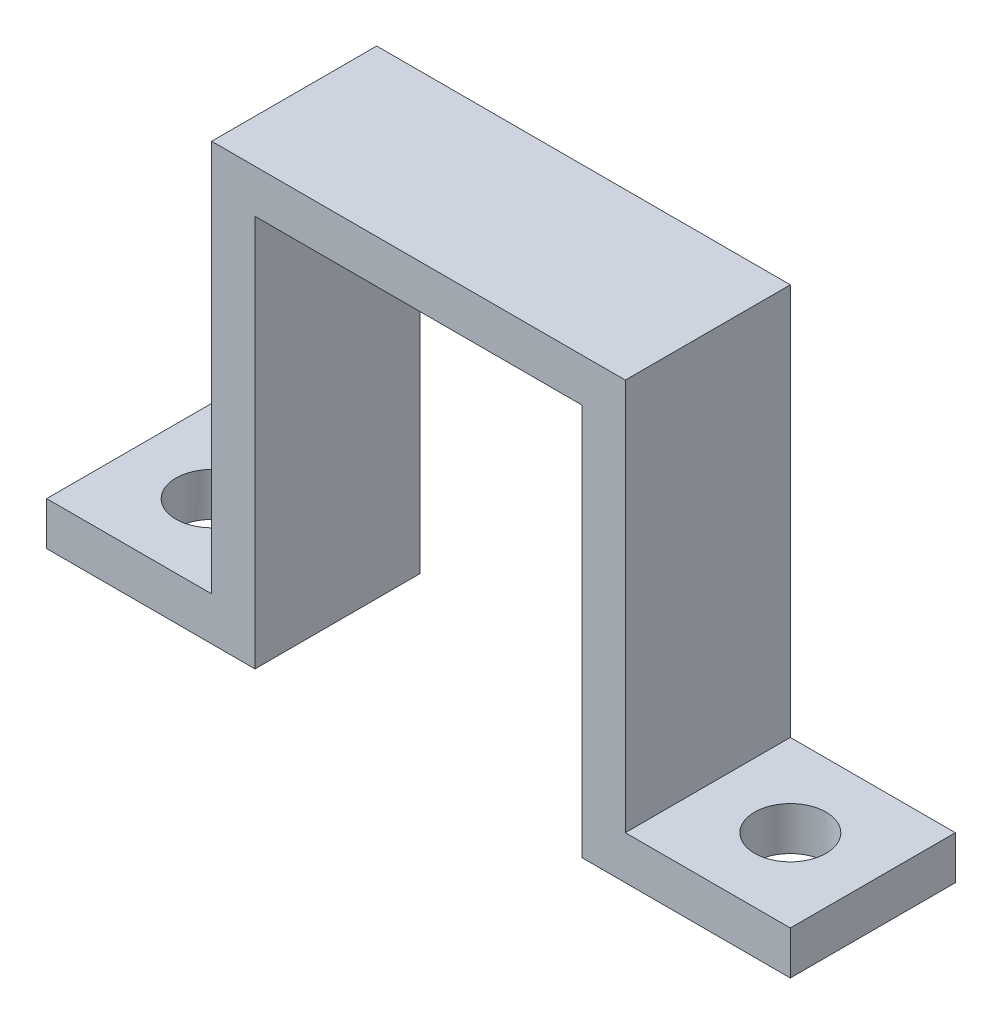
ISO-10303-21;
HEADER;
FILE_DESCRIPTION(('STEP AP214'),'2;1');
FILE_NAME('part.step','',(''),(''),'','','');
FILE_SCHEMA(('AUTOMOTIVE_DESIGN { 1 0 10303 214 1 1 1 1 }'));
ENDSEC;
DATA;
#1=APPLICATION_CONTEXT('core data for automotive mechanical design processes');
#2=APPLICATION_PROTOCOL_DEFINITION('international standard','automotive_design',2000,#1);
#3=PRODUCT_CONTEXT('',#1,'mechanical');
#4=PRODUCT('Part','Part','',(#3));
#5=PRODUCT_RELATED_PRODUCT_CATEGORY('part','',(#4));
#6=PRODUCT_DEFINITION_FORMATION('','',#4);
#7=PRODUCT_DEFINITION_CONTEXT('part definition',#1,'design');
#8=PRODUCT_DEFINITION('design','',#6,#7);
#9=PRODUCT_DEFINITION_SHAPE('','',#8);
#10=(LENGTH_UNIT() NAMED_UNIT(*) SI_UNIT(.MILLI.,.METRE.));
#11=(NAMED_UNIT(*) PLANE_ANGLE_UNIT() SI_UNIT($,.RADIAN.));
#12=(NAMED_UNIT(*) SI_UNIT($,.STERADIAN.) SOLID_ANGLE_UNIT());
#13=UNCERTAINTY_MEASURE_WITH_UNIT(LENGTH_MEASURE(1.E-05),#10,'distance_accuracy_value','');
#14=(GEOMETRIC_REPRESENTATION_CONTEXT(3) GLOBAL_UNCERTAINTY_ASSIGNED_CONTEXT((#13)) GLOBAL_UNIT_ASSIGNED_CONTEXT((#10,
#11,#12)) REPRESENTATION_CONTEXT('',''));
#15=CARTESIAN_POINT('',(0.,0.,0.));
#16=DIRECTION('',(0.,0.,1.));
#17=DIRECTION('',(1.,0.,0.));
#18=AXIS2_PLACEMENT_3D('',#15,#16,#17);
#19=CARTESIAN_POINT('',(-9.55,0.,3.81));
#20=DIRECTION('',(1.,0.,0.));
#21=DIRECTION('',(0.,1.,0.));
#22=AXIS2_PLACEMENT_3D('',#19,#20,#21);
#23=PLANE('',#22);
#24=DIRECTION('',(0.,-1.,0.));
#25=VECTOR('',#24,1.);
#26=CARTESIAN_POINT('',(-9.55,0.,-3.81));
#27=LINE('',#26,#25);
#28=CARTESIAN_POINT('',(-9.55,0.,-3.81));
#29=VERTEX_POINT('',#28);
#30=CARTESIAN_POINT('',(-9.55,-18.1,-3.81));
#31=VERTEX_POINT('',#30);
#32=EDGE_CURVE('E157',#29,#31,#27,.T.);
#33=ORIENTED_EDGE('',*,*,#32,.T.);
#34=DIRECTION('',(0.,0.,-1.));
#35=VECTOR('',#34,1.);
#36=CARTESIAN_POINT('',(-9.55,-18.1,3.81));
#37=LINE('',#36,#35);
#38=CARTESIAN_POINT('',(-9.55,-18.1,3.81));
#39=VERTEX_POINT('',#38);
#40=EDGE_CURVE('E11',#39,#31,#37,.T.);
#41=ORIENTED_EDGE('',*,*,#40,.F.);
#42=DIRECTION('',(0.,-1.,0.));
#43=VECTOR('',#42,1.);
#44=CARTESIAN_POINT('',(-9.55,0.,3.81));
#45=LINE('',#44,#43);
#46=CARTESIAN_POINT('',(-9.55,0.,3.81));
#47=VERTEX_POINT('',#46);
#48=EDGE_CURVE('E180',#47,#39,#45,.T.);
#49=ORIENTED_EDGE('',*,*,#48,.F.);
#50=DIRECTION('',(0.,0.,-1.));
#51=VECTOR('',#50,1.);
#52=CARTESIAN_POINT('',(-9.55,0.,3.81));
#53=LINE('',#52,#51);
#54=EDGE_CURVE('E153',#47,#29,#53,.T.);
#55=ORIENTED_EDGE('',*,*,#54,.T.);
#56=EDGE_LOOP('',(#33,#41,#49,#55));
#57=FACE_BOUND('',#56,.T.);
#58=ADVANCED_FACE('F37',(#57),#23,.F.);
#59=CARTESIAN_POINT('',(-9.55,-18.1,3.81));
#60=DIRECTION('',(0.,-1.,0.));
#61=DIRECTION('',(1.,0.,0.));
#62=AXIS2_PLACEMENT_3D('',#59,#60,#61);
#63=PLANE('',#62);
#64=CARTESIAN_POINT('',(-13.36,-18.1,0.));
#65=DIRECTION('',(0.,1.,0.));
#66=DIRECTION('',(0.,0.,1.));
#67=AXIS2_PLACEMENT_3D('',#64,#65,#66);
#68=CIRCLE('',#67,1.65);
#69=CARTESIAN_POINT('',(-13.36,-18.1,1.65));
#70=VERTEX_POINT('',#69);
#71=EDGE_CURVE('E300',#70,#70,#68,.T.);
#72=ORIENTED_EDGE('',*,*,#71,.F.);
#73=EDGE_LOOP('',(#72));
#74=FACE_BOUND('',#73,.T.);
#75=DIRECTION('',(-1.,0.,0.));
#76=VECTOR('',#75,1.);
#77=CARTESIAN_POINT('',(-9.55,-18.1,-3.81));
#78=LINE('',#77,#76);
#79=CARTESIAN_POINT('',(-17.17,-18.1,-3.81));
#80=VERTEX_POINT('',#79);
#81=EDGE_CURVE('E160',#31,#80,#78,.T.);
#82=ORIENTED_EDGE('',*,*,#81,.T.);
#83=DIRECTION('',(0.,0.,-1.));
#84=VECTOR('',#83,1.);
#85=CARTESIAN_POINT('',(-17.17,-18.1,3.81));
#86=LINE('',#85,#84);
#87=CARTESIAN_POINT('',(-17.17,-18.1,3.81));
#88=VERTEX_POINT('',#87);
#89=EDGE_CURVE('E45',#88,#80,#86,.T.);
#90=ORIENTED_EDGE('',*,*,#89,.F.);
#91=DIRECTION('',(-1.,0.,0.));
#92=VECTOR('',#91,1.);
#93=CARTESIAN_POINT('',(-9.55,-18.1,3.81));
#94=LINE('',#93,#92);
#95=EDGE_CURVE('E108',#39,#88,#94,.T.);
#96=ORIENTED_EDGE('',*,*,#95,.F.);
#97=ORIENTED_EDGE('',*,*,#40,.T.);
#98=EDGE_LOOP('',(#82,#90,#96,#97));
#99=FACE_BOUND('',#98,.T.);
#100=ADVANCED_FACE('F258',(#74,#99),#63,.F.);
#101=CARTESIAN_POINT('',(-17.17,-18.1,3.81));
#102=DIRECTION('',(1.,0.,0.));
#103=DIRECTION('',(0.,1.,0.));
#104=AXIS2_PLACEMENT_3D('',#101,#102,#103);
#105=PLANE('',#104);
#106=DIRECTION('',(0.,-1.,0.));
#107=VECTOR('',#106,1.);
#108=CARTESIAN_POINT('',(-17.17,-18.1,-3.81));
#109=LINE('',#108,#107);
#110=CARTESIAN_POINT('',(-17.17,-20.1,-3.81));
#111=VERTEX_POINT('',#110);
#112=EDGE_CURVE('E163',#80,#111,#109,.T.);
#113=ORIENTED_EDGE('',*,*,#112,.T.);
#114=DIRECTION('',(0.,0.,-1.));
#115=VECTOR('',#114,1.);
#116=CARTESIAN_POINT('',(-17.17,-20.1,3.81));
#117=LINE('',#116,#115);
#118=CARTESIAN_POINT('',(-17.17,-20.1,3.81));
#119=VERTEX_POINT('',#118);
#120=EDGE_CURVE('E199',#119,#111,#117,.T.);
#121=ORIENTED_EDGE('',*,*,#120,.F.);
#122=DIRECTION('',(0.,-1.,0.));
#123=VECTOR('',#122,1.);
#124=CARTESIAN_POINT('',(-17.17,-18.1,3.81));
#125=LINE('',#124,#123);
#126=EDGE_CURVE('E207',#88,#119,#125,.T.);
#127=ORIENTED_EDGE('',*,*,#126,.F.);
#128=ORIENTED_EDGE('',*,*,#89,.T.);
#129=EDGE_LOOP('',(#113,#121,#127,#128));
#130=FACE_BOUND('',#129,.T.);
#131=ADVANCED_FACE('F205',(#130),#105,.F.);
#132=CARTESIAN_POINT('',(-17.17,-20.1,3.81));
#133=DIRECTION('',(0.,1.,0.));
#134=DIRECTION('',(-1.,0.,0.));
#135=AXIS2_PLACEMENT_3D('',#132,#133,#134);
#136=PLANE('',#135);
#137=CARTESIAN_POINT('',(-13.36,-20.1,0.));
#138=DIRECTION('',(0.,1.,0.));
#139=DIRECTION('',(-1.,0.,0.));
#140=AXIS2_PLACEMENT_3D('',#137,#138,#139);
#141=CIRCLE('',#140,1.65);
#142=CARTESIAN_POINT('',(-15.01,-20.1,0.));
#143=VERTEX_POINT('',#142);
#144=EDGE_CURVE('E161',#143,#143,#141,.F.);
#145=ORIENTED_EDGE('',*,*,#144,.F.);
#146=EDGE_LOOP('',(#145));
#147=FACE_BOUND('',#146,.T.);
#148=DIRECTION('',(1.,0.,0.));
#149=VECTOR('',#148,1.);
#150=CARTESIAN_POINT('',(-17.17,-20.1,-3.81));
#151=LINE('',#150,#149);
#152=CARTESIAN_POINT('',(-7.55,-20.1,-3.81));
#153=VERTEX_POINT('',#152);
#154=EDGE_CURVE('E165',#111,#153,#151,.T.);
#155=ORIENTED_EDGE('',*,*,#154,.T.);
#156=DIRECTION('',(0.,0.,-1.));
#157=VECTOR('',#156,1.);
#158=CARTESIAN_POINT('',(-7.55,-20.1,3.81));
#159=LINE('',#158,#157);
#160=CARTESIAN_POINT('',(-7.55,-20.1,3.81));
#161=VERTEX_POINT('',#160);
#162=EDGE_CURVE('E196',#161,#153,#159,.T.);
#163=ORIENTED_EDGE('',*,*,#162,.F.);
#164=DIRECTION('',(1.,0.,0.));
#165=VECTOR('',#164,1.);
#166=CARTESIAN_POINT('',(-17.17,-20.1,3.81));
#167=LINE('',#166,#165);
#168=EDGE_CURVE('E225',#119,#161,#167,.T.);
#169=ORIENTED_EDGE('',*,*,#168,.F.);
#170=ORIENTED_EDGE('',*,*,#120,.T.);
#171=EDGE_LOOP('',(#155,#163,#169,#170));
#172=FACE_BOUND('',#171,.T.);
#173=ADVANCED_FACE('F216',(#147,#172),#136,.F.);
#174=CARTESIAN_POINT('',(-7.55,-20.1,3.81));
#175=DIRECTION('',(-1.,0.,0.));
#176=DIRECTION('',(0.,-1.,0.));
#177=AXIS2_PLACEMENT_3D('',#174,#175,#176);
#178=PLANE('',#177);
#179=DIRECTION('',(0.,1.,0.));
#180=VECTOR('',#179,1.);
#181=CARTESIAN_POINT('',(-7.55,-20.1,-3.81));
#182=LINE('',#181,#180);
#183=CARTESIAN_POINT('',(-7.55,-2.,-3.81));
#184=VERTEX_POINT('',#183);
#185=EDGE_CURVE('E167',#153,#184,#182,.T.);
#186=ORIENTED_EDGE('',*,*,#185,.T.);
#187=DIRECTION('',(0.,0.,-1.));
#188=VECTOR('',#187,1.);
#189=CARTESIAN_POINT('',(-7.55,-2.,3.81));
#190=LINE('',#189,#188);
#191=CARTESIAN_POINT('',(-7.55,-2.,3.81));
#192=VERTEX_POINT('',#191);
#193=EDGE_CURVE('E193',#192,#184,#190,.T.);
#194=ORIENTED_EDGE('',*,*,#193,.F.);
#195=DIRECTION('',(0.,1.,0.));
#196=VECTOR('',#195,1.);
#197=CARTESIAN_POINT('',(-7.55,-20.1,3.81));
#198=LINE('',#197,#196);
#199=EDGE_CURVE('E222',#161,#192,#198,.T.);
#200=ORIENTED_EDGE('',*,*,#199,.F.);
#201=ORIENTED_EDGE('',*,*,#162,.T.);
#202=EDGE_LOOP('',(#186,#194,#200,#201));
#203=FACE_BOUND('',#202,.T.);
#204=ADVANCED_FACE('F220',(#203),#178,.F.);
#205=CARTESIAN_POINT('',(-7.55,-2.,3.81));
#206=DIRECTION('',(0.,1.,0.));
#207=DIRECTION('',(0.,0.,1.));
#208=AXIS2_PLACEMENT_3D('',#205,#206,#207);
#209=PLANE('',#208);
#210=DIRECTION('',(1.,0.,0.));
#211=VECTOR('',#210,1.);
#212=CARTESIAN_POINT('',(-7.55,-2.,-3.81));
#213=LINE('',#212,#211);
#214=CARTESIAN_POINT('',(7.55,-2.,-3.81));
#215=VERTEX_POINT('',#214);
#216=EDGE_CURVE('E169',#184,#215,#213,.T.);
#217=ORIENTED_EDGE('',*,*,#216,.T.);
#218=DIRECTION('',(0.,0.,-1.));
#219=VECTOR('',#218,1.);
#220=CARTESIAN_POINT('',(7.55,-2.,3.81));
#221=LINE('',#220,#219);
#222=CARTESIAN_POINT('',(7.55,-2.,3.81));
#223=VERTEX_POINT('',#222);
#224=EDGE_CURVE('E190',#223,#215,#221,.T.);
#225=ORIENTED_EDGE('',*,*,#224,.F.);
#226=DIRECTION('',(1.,0.,0.));
#227=VECTOR('',#226,1.);
#228=CARTESIAN_POINT('',(-7.55,-2.,3.81));
#229=LINE('',#228,#227);
#230=EDGE_CURVE('E224',#192,#223,#229,.T.);
#231=ORIENTED_EDGE('',*,*,#230,.F.);
#232=ORIENTED_EDGE('',*,*,#193,.T.);
#233=EDGE_LOOP('',(#217,#225,#231,#232));
#234=FACE_BOUND('',#233,.T.);
#235=ADVANCED_FACE('F275',(#234),#209,.F.);
#236=CARTESIAN_POINT('',(7.55,-20.1,3.81));
#237=DIRECTION('',(1.,0.,0.));
#238=DIRECTION('',(0.,1.,0.));
#239=AXIS2_PLACEMENT_3D('',#236,#237,#238);
#240=PLANE('',#239);
#241=DIRECTION('',(0.,-1.,0.));
#242=VECTOR('',#241,1.);
#243=CARTESIAN_POINT('',(7.55,-20.1,-3.81));
#244=LINE('',#243,#242);
#245=CARTESIAN_POINT('',(7.55,-20.1,-3.81));
#246=VERTEX_POINT('',#245);
#247=EDGE_CURVE('E171',#215,#246,#244,.T.);
#248=ORIENTED_EDGE('',*,*,#247,.T.);
#249=DIRECTION('',(0.,0.,-1.));
#250=VECTOR('',#249,1.);
#251=CARTESIAN_POINT('',(7.55,-20.1,3.81));
#252=LINE('',#251,#250);
#253=CARTESIAN_POINT('',(7.55,-20.1,3.81));
#254=VERTEX_POINT('',#253);
#255=EDGE_CURVE('E187',#254,#246,#252,.T.);
#256=ORIENTED_EDGE('',*,*,#255,.F.);
#257=DIRECTION('',(0.,-1.,0.));
#258=VECTOR('',#257,1.);
#259=CARTESIAN_POINT('',(7.55,-20.1,3.81));
#260=LINE('',#259,#258);
#261=EDGE_CURVE('E227',#223,#254,#260,.T.);
#262=ORIENTED_EDGE('',*,*,#261,.F.);
#263=ORIENTED_EDGE('',*,*,#224,.T.);
#264=EDGE_LOOP('',(#248,#256,#262,#263));
#265=FACE_BOUND('',#264,.T.);
#266=ADVANCED_FACE('F278',(#265),#240,.F.);
#267=CARTESIAN_POINT('',(17.17,-20.1,3.81));
#268=DIRECTION('',(0.,1.,0.));
#269=DIRECTION('',(-1.,0.,0.));
#270=AXIS2_PLACEMENT_3D('',#267,#268,#269);
#271=PLANE('',#270);
#272=CARTESIAN_POINT('',(13.36,-20.1,0.));
#273=DIRECTION('',(0.,1.,0.));
#274=DIRECTION('',(-1.,0.,0.));
#275=AXIS2_PLACEMENT_3D('',#272,#273,#274);
#276=CIRCLE('',#275,1.65);
#277=CARTESIAN_POINT('',(11.71,-20.1,0.));
#278=VERTEX_POINT('',#277);
#279=EDGE_CURVE('E297',#278,#278,#276,.T.);
#280=ORIENTED_EDGE('',*,*,#279,.T.);
#281=EDGE_LOOP('',(#280));
#282=FACE_BOUND('',#281,.T.);
#283=DIRECTION('',(1.,0.,0.));
#284=VECTOR('',#283,1.);
#285=CARTESIAN_POINT('',(17.17,-20.1,-3.81));
#286=LINE('',#285,#284);
#287=CARTESIAN_POINT('',(17.17,-20.1,-3.81));
#288=VERTEX_POINT('',#287);
#289=EDGE_CURVE('E173',#246,#288,#286,.T.);
#290=ORIENTED_EDGE('',*,*,#289,.T.);
#291=DIRECTION('',(0.,0.,-1.));
#292=VECTOR('',#291,1.);
#293=CARTESIAN_POINT('',(17.17,-20.1,3.81));
#294=LINE('',#293,#292);
#295=CARTESIAN_POINT('',(17.17,-20.1,3.81));
#296=VERTEX_POINT('',#295);
#297=EDGE_CURVE('E184',#296,#288,#294,.T.);
#298=ORIENTED_EDGE('',*,*,#297,.F.);
#299=DIRECTION('',(1.,0.,0.));
#300=VECTOR('',#299,1.);
#301=CARTESIAN_POINT('',(17.17,-20.1,3.81));
#302=LINE('',#301,#300);
#303=EDGE_CURVE('E233',#254,#296,#302,.T.);
#304=ORIENTED_EDGE('',*,*,#303,.F.);
#305=ORIENTED_EDGE('',*,*,#255,.T.);
#306=EDGE_LOOP('',(#290,#298,#304,#305));
#307=FACE_BOUND('',#306,.T.);
#308=ADVANCED_FACE('F239',(#282,#307),#271,.F.);
#309=CARTESIAN_POINT('',(17.17,-18.1,3.81));
#310=DIRECTION('',(-1.,0.,0.));
#311=DIRECTION('',(0.,-1.,0.));
#312=AXIS2_PLACEMENT_3D('',#309,#310,#311);
#313=PLANE('',#312);
#314=DIRECTION('',(0.,1.,0.));
#315=VECTOR('',#314,1.);
#316=CARTESIAN_POINT('',(17.17,-18.1,-3.81));
#317=LINE('',#316,#315);
#318=CARTESIAN_POINT('',(17.17,-18.1,-3.81));
#319=VERTEX_POINT('',#318);
#320=EDGE_CURVE('E175',#288,#319,#317,.T.);
#321=ORIENTED_EDGE('',*,*,#320,.T.);
#322=DIRECTION('',(0.,0.,-1.));
#323=VECTOR('',#322,1.);
#324=CARTESIAN_POINT('',(17.17,-18.1,3.81));
#325=LINE('',#324,#323);
#326=CARTESIAN_POINT('',(17.17,-18.1,3.81));
#327=VERTEX_POINT('',#326);
#328=EDGE_CURVE('E148',#327,#319,#325,.T.);
#329=ORIENTED_EDGE('',*,*,#328,.F.);
#330=DIRECTION('',(0.,1.,0.));
#331=VECTOR('',#330,1.);
#332=CARTESIAN_POINT('',(17.17,-18.1,3.81));
#333=LINE('',#332,#331);
#334=EDGE_CURVE('E139',#296,#327,#333,.T.);
#335=ORIENTED_EDGE('',*,*,#334,.F.);
#336=ORIENTED_EDGE('',*,*,#297,.T.);
#337=EDGE_LOOP('',(#321,#329,#335,#336));
#338=FACE_BOUND('',#337,.T.);
#339=ADVANCED_FACE('F243',(#338),#313,.F.);
#340=CARTESIAN_POINT('',(9.55,-18.1,3.81));
#341=DIRECTION('',(0.,-1.,0.));
#342=DIRECTION('',(1.,0.,0.));
#343=AXIS2_PLACEMENT_3D('',#340,#341,#342);
#344=PLANE('',#343);
#345=CARTESIAN_POINT('',(13.36,-18.1,0.));
#346=DIRECTION('',(0.,-1.,0.));
#347=DIRECTION('',(0.,0.,1.));
#348=AXIS2_PLACEMENT_3D('',#345,#346,#347);
#349=CIRCLE('',#348,1.65);
#350=CARTESIAN_POINT('',(13.36,-18.1,1.65));
#351=VERTEX_POINT('',#350);
#352=EDGE_CURVE('E295',#351,#351,#349,.T.);
#353=ORIENTED_EDGE('',*,*,#352,.T.);
#354=EDGE_LOOP('',(#353));
#355=FACE_BOUND('',#354,.T.);
#356=DIRECTION('',(-1.,0.,0.));
#357=VECTOR('',#356,1.);
#358=CARTESIAN_POINT('',(9.55,-18.1,-3.81));
#359=LINE('',#358,#357);
#360=CARTESIAN_POINT('',(9.55,-18.1,-3.81));
#361=VERTEX_POINT('',#360);
#362=EDGE_CURVE('E147',#319,#361,#359,.T.);
#363=ORIENTED_EDGE('',*,*,#362,.T.);
#364=DIRECTION('',(0.,0.,-1.));
#365=VECTOR('',#364,1.);
#366=CARTESIAN_POINT('',(9.55,-18.1,3.81));
#367=LINE('',#366,#365);
#368=CARTESIAN_POINT('',(9.55,-18.1,3.81));
#369=VERTEX_POINT('',#368);
#370=EDGE_CURVE('E144',#369,#361,#367,.T.);
#371=ORIENTED_EDGE('',*,*,#370,.F.);
#372=DIRECTION('',(-1.,0.,0.));
#373=VECTOR('',#372,1.);
#374=CARTESIAN_POINT('',(9.55,-18.1,3.81));
#375=LINE('',#374,#373);
#376=EDGE_CURVE('E133',#327,#369,#375,.T.);
#377=ORIENTED_EDGE('',*,*,#376,.F.);
#378=ORIENTED_EDGE('',*,*,#328,.T.);
#379=EDGE_LOOP('',(#363,#371,#377,#378));
#380=FACE_BOUND('',#379,.T.);
#381=ADVANCED_FACE('F145',(#355,#380),#344,.F.);
#382=CARTESIAN_POINT('',(9.55,0.,3.81));
#383=DIRECTION('',(-1.,0.,0.));
#384=DIRECTION('',(0.,-1.,0.));
#385=AXIS2_PLACEMENT_3D('',#382,#383,#384);
#386=PLANE('',#385);
#387=DIRECTION('',(0.,1.,0.));
#388=VECTOR('',#387,1.);
#389=CARTESIAN_POINT('',(9.55,0.,-3.81));
#390=LINE('',#389,#388);
#391=CARTESIAN_POINT('',(9.55,0.,-3.81));
#392=VERTEX_POINT('',#391);
#393=EDGE_CURVE('E94',#361,#392,#390,.T.);
#394=ORIENTED_EDGE('',*,*,#393,.T.);
#395=DIRECTION('',(0.,0.,-1.));
#396=VECTOR('',#395,1.);
#397=CARTESIAN_POINT('',(9.55,0.,3.81));
#398=LINE('',#397,#396);
#399=CARTESIAN_POINT('',(9.55,0.,3.81));
#400=VERTEX_POINT('',#399);
#401=EDGE_CURVE('E149',#400,#392,#398,.T.);
#402=ORIENTED_EDGE('',*,*,#401,.F.);
#403=DIRECTION('',(0.,1.,0.));
#404=VECTOR('',#403,1.);
#405=CARTESIAN_POINT('',(9.55,0.,3.81));
#406=LINE('',#405,#404);
#407=EDGE_CURVE('E137',#369,#400,#406,.T.);
#408=ORIENTED_EDGE('',*,*,#407,.F.);
#409=ORIENTED_EDGE('',*,*,#370,.T.);
#410=EDGE_LOOP('',(#394,#402,#408,#409));
#411=FACE_BOUND('',#410,.T.);
#412=ADVANCED_FACE('F151',(#411),#386,.F.);
#413=CARTESIAN_POINT('',(9.55,0.,3.81));
#414=DIRECTION('',(0.,-1.,0.));
#415=DIRECTION('',(0.,0.,-1.));
#416=AXIS2_PLACEMENT_3D('',#413,#414,#415);
#417=PLANE('',#416);
#418=DIRECTION('',(-1.,0.,0.));
#419=VECTOR('',#418,1.);
#420=CARTESIAN_POINT('',(9.55,0.,-3.81));
#421=LINE('',#420,#419);
#422=EDGE_CURVE('E100',#392,#29,#421,.T.);
#423=ORIENTED_EDGE('',*,*,#422,.T.);
#424=ORIENTED_EDGE('',*,*,#54,.F.);
#425=DIRECTION('',(-1.,0.,0.));
#426=VECTOR('',#425,1.);
#427=CARTESIAN_POINT('',(9.55,0.,3.81));
#428=LINE('',#427,#426);
#429=EDGE_CURVE('E53',#400,#47,#428,.T.);
#430=ORIENTED_EDGE('',*,*,#429,.F.);
#431=ORIENTED_EDGE('',*,*,#401,.T.);
#432=EDGE_LOOP('',(#423,#424,#430,#431));
#433=FACE_BOUND('',#432,.T.);
#434=ADVANCED_FACE('F247',(#433),#417,.F.);
#435=CARTESIAN_POINT('',(0.,0.,3.81));
#436=DIRECTION('',(0.,0.,-1.));
#437=DIRECTION('',(-1.,0.,0.));
#438=AXIS2_PLACEMENT_3D('',#435,#436,#437);
#439=PLANE('',#438);
#440=ORIENTED_EDGE('',*,*,#48,.T.);
#441=ORIENTED_EDGE('',*,*,#95,.T.);
#442=ORIENTED_EDGE('',*,*,#126,.T.);
#443=ORIENTED_EDGE('',*,*,#168,.T.);
#444=ORIENTED_EDGE('',*,*,#199,.T.);
#445=ORIENTED_EDGE('',*,*,#230,.T.);
#446=ORIENTED_EDGE('',*,*,#261,.T.);
#447=ORIENTED_EDGE('',*,*,#303,.T.);
#448=ORIENTED_EDGE('',*,*,#334,.T.);
#449=ORIENTED_EDGE('',*,*,#376,.T.);
#450=ORIENTED_EDGE('',*,*,#407,.T.);
#451=ORIENTED_EDGE('',*,*,#429,.T.);
#452=EDGE_LOOP('',(#440,#441,#442,#443,#444,#445,#446,#447,#448,#449,#450,#451));
#453=FACE_BOUND('',#452,.T.);
#454=ADVANCED_FACE('F135',(#453),#439,.F.);
#455=CARTESIAN_POINT('',(0.,0.,-3.81));
#456=DIRECTION('',(0.,0.,-1.));
#457=DIRECTION('',(-1.,0.,0.));
#458=AXIS2_PLACEMENT_3D('',#455,#456,#457);
#459=PLANE('',#458);
#460=ORIENTED_EDGE('',*,*,#32,.F.);
#461=ORIENTED_EDGE('',*,*,#422,.F.);
#462=ORIENTED_EDGE('',*,*,#393,.F.);
#463=ORIENTED_EDGE('',*,*,#362,.F.);
#464=ORIENTED_EDGE('',*,*,#320,.F.);
#465=ORIENTED_EDGE('',*,*,#289,.F.);
#466=ORIENTED_EDGE('',*,*,#247,.F.);
#467=ORIENTED_EDGE('',*,*,#216,.F.);
#468=ORIENTED_EDGE('',*,*,#185,.F.);
#469=ORIENTED_EDGE('',*,*,#154,.F.);
#470=ORIENTED_EDGE('',*,*,#112,.F.);
#471=ORIENTED_EDGE('',*,*,#81,.F.);
#472=EDGE_LOOP('',(#460,#461,#462,#463,#464,#465,#466,#467,#468,#469,#470,#471));
#473=FACE_BOUND('',#472,.T.);
#474=ADVANCED_FACE('F211',(#473),#459,.T.);
#475=CARTESIAN_POINT('',(-13.36,-24.7669047558312,0.));
#476=DIRECTION('',(0.,1.,0.));
#477=DIRECTION('',(0.,0.,1.));
#478=AXIS2_PLACEMENT_3D('',#475,#476,#477);
#479=CYLINDRICAL_SURFACE('',#478,1.65);
#480=ORIENTED_EDGE('',*,*,#144,.T.);
#481=EDGE_LOOP('',(#480));
#482=FACE_BOUND('',#481,.T.);
#483=ORIENTED_EDGE('',*,*,#71,.T.);
#484=EDGE_LOOP('',(#483));
#485=FACE_BOUND('',#484,.T.);
#486=ADVANCED_FACE('F310',(#482,#485),#479,.F.);
#487=CARTESIAN_POINT('',(13.36,-24.7669047558312,0.));
#488=DIRECTION('',(0.,1.,0.));
#489=DIRECTION('',(0.,0.,1.));
#490=AXIS2_PLACEMENT_3D('',#487,#488,#489);
#491=CYLINDRICAL_SURFACE('',#490,1.65);
#492=ORIENTED_EDGE('',*,*,#279,.F.);
#493=EDGE_LOOP('',(#492));
#494=FACE_BOUND('',#493,.T.);
#495=ORIENTED_EDGE('',*,*,#352,.F.);
#496=EDGE_LOOP('',(#495));
#497=FACE_BOUND('',#496,.T.);
#498=ADVANCED_FACE('F313',(#494,#497),#491,.F.);
#499=CLOSED_SHELL('',(#58,#100,#131,#173,#204,#235,#266,#308,#339,#381,#412,#434,#454,#474,#486,#498));
#500=MANIFOLD_SOLID_BREP('B2',#499);
#501=ADVANCED_BREP_SHAPE_REPRESENTATION('',(#18,#500),#14);
#502=SHAPE_DEFINITION_REPRESENTATION(#9,#501);
ENDSEC;
END-ISO-10303-21;
